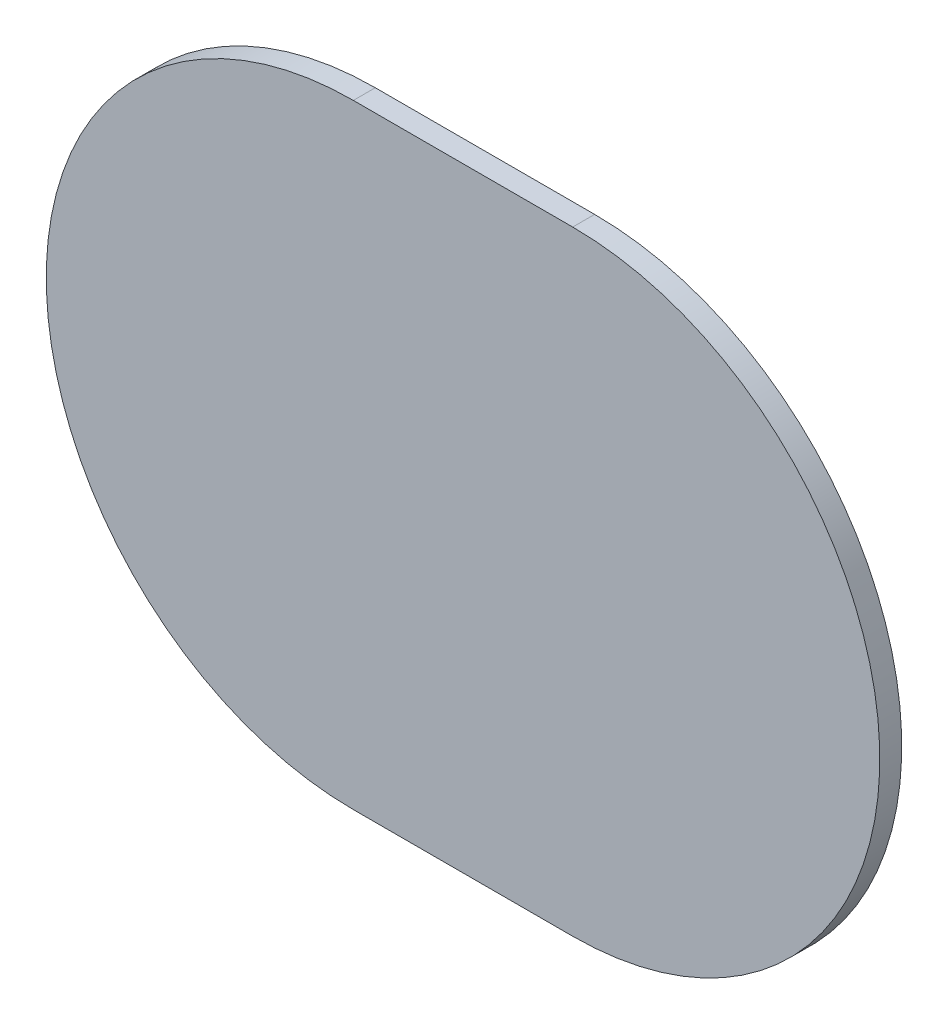
ISO-10303-21;
HEADER;
FILE_DESCRIPTION(('STEP AP214'),'2;1');
FILE_NAME('part.step','',(''),(''),'','','');
FILE_SCHEMA(('AUTOMOTIVE_DESIGN { 1 0 10303 214 1 1 1 1 }'));
ENDSEC;
DATA;
#1=APPLICATION_CONTEXT('core data for automotive mechanical design processes');
#2=APPLICATION_PROTOCOL_DEFINITION('international standard','automotive_design',2000,#1);
#3=PRODUCT_CONTEXT('',#1,'mechanical');
#4=PRODUCT('Part','Part','',(#3));
#5=PRODUCT_RELATED_PRODUCT_CATEGORY('part','',(#4));
#6=PRODUCT_DEFINITION_FORMATION('','',#4);
#7=PRODUCT_DEFINITION_CONTEXT('part definition',#1,'design');
#8=PRODUCT_DEFINITION('design','',#6,#7);
#9=PRODUCT_DEFINITION_SHAPE('','',#8);
#10=(LENGTH_UNIT() NAMED_UNIT(*) SI_UNIT(.MILLI.,.METRE.));
#11=(NAMED_UNIT(*) PLANE_ANGLE_UNIT() SI_UNIT($,.RADIAN.));
#12=(NAMED_UNIT(*) SI_UNIT($,.STERADIAN.) SOLID_ANGLE_UNIT());
#13=UNCERTAINTY_MEASURE_WITH_UNIT(LENGTH_MEASURE(1.E-05),#10,'distance_accuracy_value','');
#14=(GEOMETRIC_REPRESENTATION_CONTEXT(3) GLOBAL_UNCERTAINTY_ASSIGNED_CONTEXT((#13)) GLOBAL_UNIT_ASSIGNED_CONTEXT((#10,
#11,#12)) REPRESENTATION_CONTEXT('',''));
#15=CARTESIAN_POINT('',(0.,0.,0.));
#16=DIRECTION('',(0.,0.,1.));
#17=DIRECTION('',(1.,0.,0.));
#18=AXIS2_PLACEMENT_3D('',#15,#16,#17);
#19=CARTESIAN_POINT('',(-20.,0.,2.));
#20=DIRECTION('',(0.,0.,-1.));
#21=DIRECTION('',(-1.,0.,0.));
#22=AXIS2_PLACEMENT_3D('',#19,#20,#21);
#23=CYLINDRICAL_SURFACE('',#22,28.);
#24=CARTESIAN_POINT('',(-20.,0.,0.));
#25=DIRECTION('',(0.,0.,1.));
#26=DIRECTION('',(1.,0.,0.));
#27=AXIS2_PLACEMENT_3D('',#24,#25,#26);
#28=CIRCLE('',#27,28.);
#29=CARTESIAN_POINT('',(-20.,28.,0.));
#30=VERTEX_POINT('',#29);
#31=CARTESIAN_POINT('',(-20.,-28.,0.));
#32=VERTEX_POINT('',#31);
#33=EDGE_CURVE('E98',#30,#32,#28,.T.);
#34=ORIENTED_EDGE('',*,*,#33,.T.);
#35=DIRECTION('',(0.,0.,-1.));
#36=VECTOR('',#35,1.);
#37=CARTESIAN_POINT('',(-20.,-28.,2.));
#38=LINE('',#37,#36);
#39=CARTESIAN_POINT('',(-20.,-28.,2.));
#40=VERTEX_POINT('',#39);
#41=EDGE_CURVE('E11',#40,#32,#38,.T.);
#42=ORIENTED_EDGE('',*,*,#41,.F.);
#43=CARTESIAN_POINT('',(-20.,0.,2.));
#44=DIRECTION('',(0.,0.,1.));
#45=DIRECTION('',(1.,0.,0.));
#46=AXIS2_PLACEMENT_3D('',#43,#44,#45);
#47=CIRCLE('',#46,28.);
#48=CARTESIAN_POINT('',(-20.,28.,2.));
#49=VERTEX_POINT('',#48);
#50=EDGE_CURVE('E86',#49,#40,#47,.T.);
#51=ORIENTED_EDGE('',*,*,#50,.F.);
#52=DIRECTION('',(0.,0.,-1.));
#53=VECTOR('',#52,1.);
#54=CARTESIAN_POINT('',(-20.,28.,2.));
#55=LINE('',#54,#53);
#56=EDGE_CURVE('E94',#49,#30,#55,.T.);
#57=ORIENTED_EDGE('',*,*,#56,.T.);
#58=EDGE_LOOP('',(#34,#42,#51,#57));
#59=FACE_BOUND('',#58,.T.);
#60=ADVANCED_FACE('F35',(#59),#23,.T.);
#61=CARTESIAN_POINT('',(0.,-28.,2.));
#62=DIRECTION('',(0.,1.,0.));
#63=DIRECTION('',(0.,0.,1.));
#64=AXIS2_PLACEMENT_3D('',#61,#62,#63);
#65=PLANE('',#64);
#66=DIRECTION('',(1.,0.,0.));
#67=VECTOR('',#66,1.);
#68=CARTESIAN_POINT('',(0.,-28.,0.));
#69=LINE('',#68,#67);
#70=CARTESIAN_POINT('',(0.,-28.,0.));
#71=VERTEX_POINT('',#70);
#72=EDGE_CURVE('E90',#32,#71,#69,.T.);
#73=ORIENTED_EDGE('',*,*,#72,.T.);
#74=DIRECTION('',(0.,0.,-1.));
#75=VECTOR('',#74,1.);
#76=CARTESIAN_POINT('',(0.,-28.,2.));
#77=LINE('',#76,#75);
#78=CARTESIAN_POINT('',(0.,-28.,2.));
#79=VERTEX_POINT('',#78);
#80=EDGE_CURVE('E43',#79,#71,#77,.T.);
#81=ORIENTED_EDGE('',*,*,#80,.F.);
#82=DIRECTION('',(1.,0.,0.));
#83=VECTOR('',#82,1.);
#84=CARTESIAN_POINT('',(0.,-28.,2.));
#85=LINE('',#84,#83);
#86=EDGE_CURVE('E81',#40,#79,#85,.T.);
#87=ORIENTED_EDGE('',*,*,#86,.F.);
#88=ORIENTED_EDGE('',*,*,#41,.T.);
#89=EDGE_LOOP('',(#73,#81,#87,#88));
#90=FACE_BOUND('',#89,.T.);
#91=ADVANCED_FACE('F89',(#90),#65,.F.);
#92=CARTESIAN_POINT('',(0.,0.,2.));
#93=DIRECTION('',(0.,0.,-1.));
#94=DIRECTION('',(-1.,0.,0.));
#95=AXIS2_PLACEMENT_3D('',#92,#93,#94);
#96=CYLINDRICAL_SURFACE('',#95,28.);
#97=CARTESIAN_POINT('',(0.,0.,0.));
#98=DIRECTION('',(0.,0.,1.));
#99=DIRECTION('',(1.,0.,0.));
#100=AXIS2_PLACEMENT_3D('',#97,#98,#99);
#101=CIRCLE('',#100,28.);
#102=CARTESIAN_POINT('',(0.,28.,0.));
#103=VERTEX_POINT('',#102);
#104=EDGE_CURVE('E68',#71,#103,#101,.T.);
#105=ORIENTED_EDGE('',*,*,#104,.T.);
#106=DIRECTION('',(0.,0.,-1.));
#107=VECTOR('',#106,1.);
#108=CARTESIAN_POINT('',(0.,28.,2.));
#109=LINE('',#108,#107);
#110=CARTESIAN_POINT('',(0.,28.,2.));
#111=VERTEX_POINT('',#110);
#112=EDGE_CURVE('E91',#111,#103,#109,.T.);
#113=ORIENTED_EDGE('',*,*,#112,.F.);
#114=CARTESIAN_POINT('',(0.,0.,2.));
#115=DIRECTION('',(0.,0.,1.));
#116=DIRECTION('',(1.,0.,0.));
#117=AXIS2_PLACEMENT_3D('',#114,#115,#116);
#118=CIRCLE('',#117,28.);
#119=EDGE_CURVE('E84',#79,#111,#118,.T.);
#120=ORIENTED_EDGE('',*,*,#119,.F.);
#121=ORIENTED_EDGE('',*,*,#80,.T.);
#122=EDGE_LOOP('',(#105,#113,#120,#121));
#123=FACE_BOUND('',#122,.T.);
#124=ADVANCED_FACE('F92',(#123),#96,.T.);
#125=CARTESIAN_POINT('',(-20.,28.,2.));
#126=DIRECTION('',(0.,-1.,0.));
#127=DIRECTION('',(0.,0.,-1.));
#128=AXIS2_PLACEMENT_3D('',#125,#126,#127);
#129=PLANE('',#128);
#130=DIRECTION('',(-1.,0.,0.));
#131=VECTOR('',#130,1.);
#132=CARTESIAN_POINT('',(-20.,28.,0.));
#133=LINE('',#132,#131);
#134=EDGE_CURVE('E74',#103,#30,#133,.T.);
#135=ORIENTED_EDGE('',*,*,#134,.T.);
#136=ORIENTED_EDGE('',*,*,#56,.F.);
#137=DIRECTION('',(-1.,0.,0.));
#138=VECTOR('',#137,1.);
#139=CARTESIAN_POINT('',(-20.,28.,2.));
#140=LINE('',#139,#138);
#141=EDGE_CURVE('E51',#111,#49,#140,.T.);
#142=ORIENTED_EDGE('',*,*,#141,.F.);
#143=ORIENTED_EDGE('',*,*,#112,.T.);
#144=EDGE_LOOP('',(#135,#136,#142,#143));
#145=FACE_BOUND('',#144,.T.);
#146=ADVANCED_FACE('F105',(#145),#129,.F.);
#147=CARTESIAN_POINT('',(-20.,0.,2.));
#148=DIRECTION('',(0.,0.,1.));
#149=DIRECTION('',(1.,0.,0.));
#150=AXIS2_PLACEMENT_3D('',#147,#148,#149);
#151=PLANE('',#150);
#152=ORIENTED_EDGE('',*,*,#50,.T.);
#153=ORIENTED_EDGE('',*,*,#86,.T.);
#154=ORIENTED_EDGE('',*,*,#119,.T.);
#155=ORIENTED_EDGE('',*,*,#141,.T.);
#156=EDGE_LOOP('',(#152,#153,#154,#155));
#157=FACE_BOUND('',#156,.T.);
#158=ADVANCED_FACE('F82',(#157),#151,.T.);
#159=CARTESIAN_POINT('',(-20.,0.,0.));
#160=DIRECTION('',(0.,0.,1.));
#161=DIRECTION('',(1.,0.,0.));
#162=AXIS2_PLACEMENT_3D('',#159,#160,#161);
#163=PLANE('',#162);
#164=ORIENTED_EDGE('',*,*,#33,.F.);
#165=ORIENTED_EDGE('',*,*,#134,.F.);
#166=ORIENTED_EDGE('',*,*,#104,.F.);
#167=ORIENTED_EDGE('',*,*,#72,.F.);
#168=EDGE_LOOP('',(#164,#165,#166,#167));
#169=FACE_BOUND('',#168,.T.);
#170=ADVANCED_FACE('F108',(#169),#163,.F.);
#171=CLOSED_SHELL('',(#60,#91,#124,#146,#158,#170));
#172=MANIFOLD_SOLID_BREP('B2',#171);
#173=ADVANCED_BREP_SHAPE_REPRESENTATION('',(#18,#172),#14);
#174=SHAPE_DEFINITION_REPRESENTATION(#9,#173);
ENDSEC;
END-ISO-10303-21;
